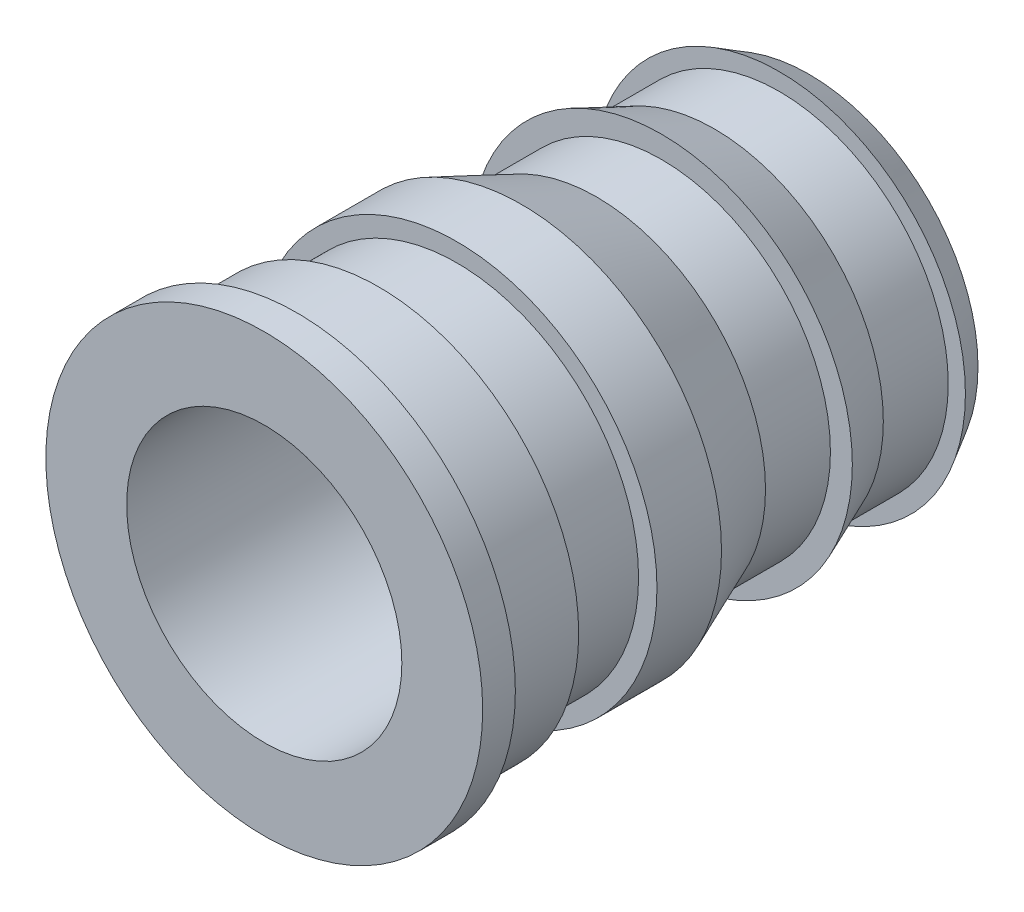
ISO-10303-21;
HEADER;
FILE_DESCRIPTION(('STEP AP214'),'2;1');
FILE_NAME('part.step','',(''),(''),'','','');
FILE_SCHEMA(('AUTOMOTIVE_DESIGN { 1 0 10303 214 1 1 1 1 }'));
ENDSEC;
DATA;
#1=APPLICATION_CONTEXT('core data for automotive mechanical design processes');
#2=APPLICATION_PROTOCOL_DEFINITION('international standard','automotive_design',2000,#1);
#3=PRODUCT_CONTEXT('',#1,'mechanical');
#4=PRODUCT('Part','Part','',(#3));
#5=PRODUCT_RELATED_PRODUCT_CATEGORY('part','',(#4));
#6=PRODUCT_DEFINITION_FORMATION('','',#4);
#7=PRODUCT_DEFINITION_CONTEXT('part definition',#1,'design');
#8=PRODUCT_DEFINITION('design','',#6,#7);
#9=PRODUCT_DEFINITION_SHAPE('','',#8);
#10=(LENGTH_UNIT() NAMED_UNIT(*) SI_UNIT(.MILLI.,.METRE.));
#11=(NAMED_UNIT(*) PLANE_ANGLE_UNIT() SI_UNIT($,.RADIAN.));
#12=(NAMED_UNIT(*) SI_UNIT($,.STERADIAN.) SOLID_ANGLE_UNIT());
#13=UNCERTAINTY_MEASURE_WITH_UNIT(LENGTH_MEASURE(1.E-05),#10,'distance_accuracy_value','');
#14=(GEOMETRIC_REPRESENTATION_CONTEXT(3) GLOBAL_UNCERTAINTY_ASSIGNED_CONTEXT((#13)) GLOBAL_UNIT_ASSIGNED_CONTEXT((#10,
#11,#12)) REPRESENTATION_CONTEXT('',''));
#15=CARTESIAN_POINT('',(0.,0.,0.));
#16=DIRECTION('',(0.,0.,1.));
#17=DIRECTION('',(1.,0.,0.));
#18=AXIS2_PLACEMENT_3D('',#15,#16,#17);
#19=CARTESIAN_POINT('',(0.,0.,3.96));
#20=DIRECTION('',(0.,0.,1.));
#21=DIRECTION('',(1.,0.,0.));
#22=AXIS2_PLACEMENT_3D('',#19,#20,#21);
#23=CYLINDRICAL_SURFACE('',#22,2.);
#24=CARTESIAN_POINT('',(0.,0.,-3.96));
#25=DIRECTION('',(0.,0.,1.));
#26=DIRECTION('',(1.,0.,0.));
#27=AXIS2_PLACEMENT_3D('',#24,#25,#26);
#28=CIRCLE('',#27,2.);
#29=CARTESIAN_POINT('',(2.,0.,-3.96));
#30=VERTEX_POINT('',#29);
#31=EDGE_CURVE('E110',#30,#30,#28,.T.);
#32=ORIENTED_EDGE('',*,*,#31,.F.);
#33=EDGE_LOOP('',(#32));
#34=FACE_BOUND('',#33,.T.);
#35=CARTESIAN_POINT('',(0.,0.,3.96));
#36=DIRECTION('',(0.,0.,1.));
#37=DIRECTION('',(1.,0.,0.));
#38=AXIS2_PLACEMENT_3D('',#35,#36,#37);
#39=CIRCLE('',#38,2.);
#40=CARTESIAN_POINT('',(2.,0.,3.96));
#41=VERTEX_POINT('',#40);
#42=EDGE_CURVE('E10',#41,#41,#39,.T.);
#43=ORIENTED_EDGE('',*,*,#42,.T.);
#44=EDGE_LOOP('',(#43));
#45=FACE_BOUND('',#44,.T.);
#46=ADVANCED_FACE('F39',(#34,#45),#23,.F.);
#47=CARTESIAN_POINT('',(0.,2.,3.96));
#48=DIRECTION('',(0.,0.,-1.));
#49=DIRECTION('',(-1.,0.,0.));
#50=AXIS2_PLACEMENT_3D('',#47,#48,#49);
#51=PLANE('',#50);
#52=ORIENTED_EDGE('',*,*,#42,.F.);
#53=EDGE_LOOP('',(#52));
#54=FACE_BOUND('',#53,.T.);
#55=CARTESIAN_POINT('',(0.,0.,3.96));
#56=DIRECTION('',(0.,0.,1.));
#57=DIRECTION('',(1.,0.,0.));
#58=AXIS2_PLACEMENT_3D('',#55,#56,#57);
#59=CIRCLE('',#58,3.175);
#60=CARTESIAN_POINT('',(3.175,0.,3.96));
#61=VERTEX_POINT('',#60);
#62=EDGE_CURVE('E46',#61,#61,#59,.T.);
#63=ORIENTED_EDGE('',*,*,#62,.T.);
#64=EDGE_LOOP('',(#63));
#65=FACE_BOUND('',#64,.T.);
#66=ADVANCED_FACE('F118',(#54,#65),#51,.F.);
#67=CARTESIAN_POINT('',(0.,0.,3.96));
#68=DIRECTION('',(0.,0.,1.));
#69=DIRECTION('',(1.,0.,0.));
#70=AXIS2_PLACEMENT_3D('',#67,#68,#69);
#71=CYLINDRICAL_SURFACE('',#70,3.175);
#72=ORIENTED_EDGE('',*,*,#62,.F.);
#73=EDGE_LOOP('',(#72));
#74=FACE_BOUND('',#73,.T.);
#75=CARTESIAN_POINT('',(0.,0.,3.4848));
#76=DIRECTION('',(0.,0.,1.));
#77=DIRECTION('',(1.,0.,0.));
#78=AXIS2_PLACEMENT_3D('',#75,#76,#77);
#79=CIRCLE('',#78,3.175);
#80=CARTESIAN_POINT('',(3.175,0.,3.4848));
#81=VERTEX_POINT('',#80);
#82=EDGE_CURVE('E51',#81,#81,#79,.T.);
#83=ORIENTED_EDGE('',*,*,#82,.T.);
#84=EDGE_LOOP('',(#83));
#85=FACE_BOUND('',#84,.T.);
#86=ADVANCED_FACE('F122',(#74,#85),#71,.T.);
#87=CARTESIAN_POINT('',(0.,3.175,3.4848));
#88=DIRECTION('',(0.,0.,1.));
#89=DIRECTION('',(1.,0.,0.));
#90=AXIS2_PLACEMENT_3D('',#87,#88,#89);
#91=PLANE('',#90);
#92=ORIENTED_EDGE('',*,*,#82,.F.);
#93=EDGE_LOOP('',(#92));
#94=FACE_BOUND('',#93,.T.);
#95=CARTESIAN_POINT('',(0.,0.,3.4848));
#96=DIRECTION('',(0.,0.,1.));
#97=DIRECTION('',(1.,0.,0.));
#98=AXIS2_PLACEMENT_3D('',#95,#96,#97);
#99=CIRCLE('',#98,2.9075);
#100=CARTESIAN_POINT('',(2.9075,0.,3.4848));
#101=VERTEX_POINT('',#100);
#102=EDGE_CURVE('E56',#101,#101,#99,.T.);
#103=ORIENTED_EDGE('',*,*,#102,.T.);
#104=EDGE_LOOP('',(#103));
#105=FACE_BOUND('',#104,.T.);
#106=ADVANCED_FACE('F127',(#94,#105),#91,.F.);
#107=CARTESIAN_POINT('',(0.,0.,3.96));
#108=DIRECTION('',(0.,0.,1.));
#109=DIRECTION('',(1.,0.,0.));
#110=AXIS2_PLACEMENT_3D('',#107,#108,#109);
#111=CYLINDRICAL_SURFACE('',#110,2.9075);
#112=ORIENTED_EDGE('',*,*,#102,.F.);
#113=EDGE_LOOP('',(#112));
#114=FACE_BOUND('',#113,.T.);
#115=CARTESIAN_POINT('',(0.,0.,2.2968));
#116=DIRECTION('',(0.,0.,1.));
#117=DIRECTION('',(1.,0.,0.));
#118=AXIS2_PLACEMENT_3D('',#115,#116,#117);
#119=CIRCLE('',#118,2.9075);
#120=CARTESIAN_POINT('',(2.9075,0.,2.2968));
#121=VERTEX_POINT('',#120);
#122=EDGE_CURVE('E62',#121,#121,#119,.T.);
#123=ORIENTED_EDGE('',*,*,#122,.T.);
#124=EDGE_LOOP('',(#123));
#125=FACE_BOUND('',#124,.T.);
#126=ADVANCED_FACE('F133',(#114,#125),#111,.T.);
#127=CARTESIAN_POINT('',(0.,2.9075,2.2968));
#128=DIRECTION('',(0.,0.,1.));
#129=DIRECTION('',(1.,0.,0.));
#130=AXIS2_PLACEMENT_3D('',#127,#128,#129);
#131=PLANE('',#130);
#132=ORIENTED_EDGE('',*,*,#122,.F.);
#133=EDGE_LOOP('',(#132));
#134=FACE_BOUND('',#133,.T.);
#135=CARTESIAN_POINT('',(0.,0.,2.2968));
#136=DIRECTION('',(0.,0.,1.));
#137=DIRECTION('',(1.,0.,0.));
#138=AXIS2_PLACEMENT_3D('',#135,#136,#137);
#139=CIRCLE('',#138,2.64);
#140=CARTESIAN_POINT('',(2.64,0.,2.2968));
#141=VERTEX_POINT('',#140);
#142=EDGE_CURVE('E66',#141,#141,#139,.T.);
#143=ORIENTED_EDGE('',*,*,#142,.T.);
#144=EDGE_LOOP('',(#143));
#145=FACE_BOUND('',#144,.T.);
#146=ADVANCED_FACE('F137',(#134,#145),#131,.F.);
#147=CARTESIAN_POINT('',(0.,0.,3.96));
#148=DIRECTION('',(0.,0.,1.));
#149=DIRECTION('',(1.,0.,0.));
#150=AXIS2_PLACEMENT_3D('',#147,#148,#149);
#151=CYLINDRICAL_SURFACE('',#150,2.64);
#152=ORIENTED_EDGE('',*,*,#142,.F.);
#153=EDGE_LOOP('',(#152));
#154=FACE_BOUND('',#153,.T.);
#155=CARTESIAN_POINT('',(0.,0.,1.15894666632655));
#156=DIRECTION('',(0.,0.,1.));
#157=DIRECTION('',(1.,0.,0.));
#158=AXIS2_PLACEMENT_3D('',#155,#156,#157);
#159=CIRCLE('',#158,2.64);
#160=CARTESIAN_POINT('',(2.64,0.,1.15894666632655));
#161=VERTEX_POINT('',#160);
#162=EDGE_CURVE('E70',#161,#161,#159,.T.);
#163=ORIENTED_EDGE('',*,*,#162,.T.);
#164=EDGE_LOOP('',(#163));
#165=FACE_BOUND('',#164,.T.);
#166=ADVANCED_FACE('F141',(#154,#165),#151,.T.);
#167=CARTESIAN_POINT('',(0.,2.64,1.15894666632655));
#168=DIRECTION('',(0.,0.,-1.));
#169=DIRECTION('',(-1.,0.,0.));
#170=AXIS2_PLACEMENT_3D('',#167,#168,#169);
#171=PLANE('',#170);
#172=ORIENTED_EDGE('',*,*,#162,.F.);
#173=EDGE_LOOP('',(#172));
#174=FACE_BOUND('',#173,.T.);
#175=CARTESIAN_POINT('',(0.,0.,1.15894666632655));
#176=DIRECTION('',(0.,0.,1.));
#177=DIRECTION('',(1.,0.,0.));
#178=AXIS2_PLACEMENT_3D('',#175,#176,#177);
#179=CIRCLE('',#178,2.9075);
#180=CARTESIAN_POINT('',(2.9075,0.,1.15894666632655));
#181=VERTEX_POINT('',#180);
#182=EDGE_CURVE('E74',#181,#181,#179,.T.);
#183=ORIENTED_EDGE('',*,*,#182,.T.);
#184=EDGE_LOOP('',(#183));
#185=FACE_BOUND('',#184,.T.);
#186=ADVANCED_FACE('F145',(#174,#185),#171,.F.);
#187=CARTESIAN_POINT('',(0.,0.,3.96));
#188=DIRECTION('',(0.,0.,1.));
#189=DIRECTION('',(1.,0.,0.));
#190=AXIS2_PLACEMENT_3D('',#187,#188,#189);
#191=CYLINDRICAL_SURFACE('',#190,2.9075);
#192=ORIENTED_EDGE('',*,*,#182,.F.);
#193=EDGE_LOOP('',(#192));
#194=FACE_BOUND('',#193,.T.);
#195=CARTESIAN_POINT('',(0.,0.,0.220748794261348));
#196=DIRECTION('',(0.,0.,1.));
#197=DIRECTION('',(1.,0.,0.));
#198=AXIS2_PLACEMENT_3D('',#195,#196,#197);
#199=CIRCLE('',#198,2.9075);
#200=CARTESIAN_POINT('',(2.9075,0.,0.220748794261348));
#201=VERTEX_POINT('',#200);
#202=EDGE_CURVE('E78',#201,#201,#199,.T.);
#203=ORIENTED_EDGE('',*,*,#202,.T.);
#204=EDGE_LOOP('',(#203));
#205=FACE_BOUND('',#204,.T.);
#206=ADVANCED_FACE('F149',(#194,#205),#191,.T.);
#207=CARTESIAN_POINT('',(0.,0.,-0.8712));
#208=DIRECTION('',(0.,0.,1.));
#209=DIRECTION('',(1.,0.,0.));
#210=AXIS2_PLACEMENT_3D('',#207,#208,#209);
#211=CONICAL_SURFACE('',#210,2.4552,0.392699081698725);
#212=ORIENTED_EDGE('',*,*,#202,.F.);
#213=EDGE_LOOP('',(#212));
#214=FACE_BOUND('',#213,.T.);
#215=CARTESIAN_POINT('',(0.,0.,-0.8712));
#216=DIRECTION('',(0.,0.,1.));
#217=DIRECTION('',(1.,0.,0.));
#218=AXIS2_PLACEMENT_3D('',#215,#216,#217);
#219=CIRCLE('',#218,2.4552);
#220=CARTESIAN_POINT('',(2.4552,0.,-0.8712));
#221=VERTEX_POINT('',#220);
#222=EDGE_CURVE('E82',#221,#221,#219,.T.);
#223=ORIENTED_EDGE('',*,*,#222,.T.);
#224=EDGE_LOOP('',(#223));
#225=FACE_BOUND('',#224,.T.);
#226=ADVANCED_FACE('F153',(#214,#225),#211,.T.);
#227=CARTESIAN_POINT('',(0.,0.,3.96));
#228=DIRECTION('',(0.,0.,1.));
#229=DIRECTION('',(1.,0.,0.));
#230=AXIS2_PLACEMENT_3D('',#227,#228,#229);
#231=CYLINDRICAL_SURFACE('',#230,2.4552);
#232=ORIENTED_EDGE('',*,*,#222,.F.);
#233=EDGE_LOOP('',(#232));
#234=FACE_BOUND('',#233,.T.);
#235=CARTESIAN_POINT('',(0.,0.,-1.81474298898767));
#236=DIRECTION('',(0.,0.,1.));
#237=DIRECTION('',(1.,0.,0.));
#238=AXIS2_PLACEMENT_3D('',#235,#236,#237);
#239=CIRCLE('',#238,2.4552);
#240=CARTESIAN_POINT('',(2.4552,0.,-1.81474298898767));
#241=VERTEX_POINT('',#240);
#242=EDGE_CURVE('E86',#241,#241,#239,.T.);
#243=ORIENTED_EDGE('',*,*,#242,.T.);
#244=EDGE_LOOP('',(#243));
#245=FACE_BOUND('',#244,.T.);
#246=ADVANCED_FACE('F157',(#234,#245),#231,.T.);
#247=CARTESIAN_POINT('',(0.,2.77375,-1.81474298898767));
#248=DIRECTION('',(0.,0.,-1.));
#249=DIRECTION('',(-1.,0.,0.));
#250=AXIS2_PLACEMENT_3D('',#247,#248,#249);
#251=PLANE('',#250);
#252=ORIENTED_EDGE('',*,*,#242,.F.);
#253=EDGE_LOOP('',(#252));
#254=FACE_BOUND('',#253,.T.);
#255=CARTESIAN_POINT('',(0.,0.,-1.81474298898767));
#256=DIRECTION('',(0.,0.,1.));
#257=DIRECTION('',(1.,0.,0.));
#258=AXIS2_PLACEMENT_3D('',#255,#256,#257);
#259=CIRCLE('',#258,2.77375);
#260=CARTESIAN_POINT('',(2.77375,0.,-1.81474298898767));
#261=VERTEX_POINT('',#260);
#262=EDGE_CURVE('E90',#261,#261,#259,.T.);
#263=ORIENTED_EDGE('',*,*,#262,.T.);
#264=EDGE_LOOP('',(#263));
#265=FACE_BOUND('',#264,.T.);
#266=ADVANCED_FACE('F161',(#254,#265),#251,.F.);
#267=CARTESIAN_POINT('',(0.,0.,-2.58379071928162));
#268=DIRECTION('',(0.,0.,1.));
#269=DIRECTION('',(1.,0.,0.));
#270=AXIS2_PLACEMENT_3D('',#267,#268,#269);
#271=CONICAL_SURFACE('',#270,2.4552,0.392699081698724);
#272=ORIENTED_EDGE('',*,*,#262,.F.);
#273=EDGE_LOOP('',(#272));
#274=FACE_BOUND('',#273,.T.);
#275=CARTESIAN_POINT('',(0.,0.,-2.58379071928162));
#276=DIRECTION('',(0.,0.,1.));
#277=DIRECTION('',(1.,0.,0.));
#278=AXIS2_PLACEMENT_3D('',#275,#276,#277);
#279=CIRCLE('',#278,2.4552);
#280=CARTESIAN_POINT('',(2.4552,0.,-2.58379071928162));
#281=VERTEX_POINT('',#280);
#282=EDGE_CURVE('E94',#281,#281,#279,.T.);
#283=ORIENTED_EDGE('',*,*,#282,.T.);
#284=EDGE_LOOP('',(#283));
#285=FACE_BOUND('',#284,.T.);
#286=ADVANCED_FACE('F165',(#274,#285),#271,.T.);
#287=CARTESIAN_POINT('',(0.,0.,3.96));
#288=DIRECTION('',(0.,0.,1.));
#289=DIRECTION('',(1.,0.,0.));
#290=AXIS2_PLACEMENT_3D('',#287,#288,#289);
#291=CYLINDRICAL_SURFACE('',#290,2.4552);
#292=ORIENTED_EDGE('',*,*,#282,.F.);
#293=EDGE_LOOP('',(#292));
#294=FACE_BOUND('',#293,.T.);
#295=CARTESIAN_POINT('',(0.,0.,-3.5273337082693));
#296=DIRECTION('',(0.,0.,1.));
#297=DIRECTION('',(1.,0.,0.));
#298=AXIS2_PLACEMENT_3D('',#295,#296,#297);
#299=CIRCLE('',#298,2.4552);
#300=CARTESIAN_POINT('',(2.4552,0.,-3.5273337082693));
#301=VERTEX_POINT('',#300);
#302=EDGE_CURVE('E98',#301,#301,#299,.T.);
#303=ORIENTED_EDGE('',*,*,#302,.T.);
#304=EDGE_LOOP('',(#303));
#305=FACE_BOUND('',#304,.T.);
#306=ADVANCED_FACE('F169',(#294,#305),#291,.T.);
#307=CARTESIAN_POINT('',(0.,2.4552,-3.5273337082693));
#308=DIRECTION('',(0.,0.,-1.));
#309=DIRECTION('',(-1.,0.,0.));
#310=AXIS2_PLACEMENT_3D('',#307,#308,#309);
#311=PLANE('',#310);
#312=ORIENTED_EDGE('',*,*,#302,.F.);
#313=EDGE_LOOP('',(#312));
#314=FACE_BOUND('',#313,.T.);
#315=CARTESIAN_POINT('',(0.,0.,-3.5273337082693));
#316=DIRECTION('',(0.,0.,1.));
#317=DIRECTION('',(1.,0.,0.));
#318=AXIS2_PLACEMENT_3D('',#315,#316,#317);
#319=CIRCLE('',#318,2.705);
#320=CARTESIAN_POINT('',(2.705,0.,-3.5273337082693));
#321=VERTEX_POINT('',#320);
#322=EDGE_CURVE('E102',#321,#321,#319,.T.);
#323=ORIENTED_EDGE('',*,*,#322,.T.);
#324=EDGE_LOOP('',(#323));
#325=FACE_BOUND('',#324,.T.);
#326=ADVANCED_FACE('F173',(#314,#325),#311,.F.);
#327=CARTESIAN_POINT('',(0.,0.,-3.96));
#328=DIRECTION('',(0.,0.,1.));
#329=DIRECTION('',(1.,0.,0.));
#330=AXIS2_PLACEMENT_3D('',#327,#328,#329);
#331=CONICAL_SURFACE('',#330,2.4552,0.5235987755983);
#332=ORIENTED_EDGE('',*,*,#322,.F.);
#333=EDGE_LOOP('',(#332));
#334=FACE_BOUND('',#333,.T.);
#335=CARTESIAN_POINT('',(0.,0.,-3.96));
#336=DIRECTION('',(0.,0.,1.));
#337=DIRECTION('',(1.,0.,0.));
#338=AXIS2_PLACEMENT_3D('',#335,#336,#337);
#339=CIRCLE('',#338,2.4552);
#340=CARTESIAN_POINT('',(2.4552,0.,-3.96));
#341=VERTEX_POINT('',#340);
#342=EDGE_CURVE('E106',#341,#341,#339,.T.);
#343=ORIENTED_EDGE('',*,*,#342,.T.);
#344=EDGE_LOOP('',(#343));
#345=FACE_BOUND('',#344,.T.);
#346=ADVANCED_FACE('F177',(#334,#345),#331,.T.);
#347=CARTESIAN_POINT('',(0.,2.4552,-3.96));
#348=DIRECTION('',(0.,0.,1.));
#349=DIRECTION('',(1.,0.,0.));
#350=AXIS2_PLACEMENT_3D('',#347,#348,#349);
#351=PLANE('',#350);
#352=ORIENTED_EDGE('',*,*,#342,.F.);
#353=EDGE_LOOP('',(#352));
#354=FACE_BOUND('',#353,.T.);
#355=ORIENTED_EDGE('',*,*,#31,.T.);
#356=EDGE_LOOP('',(#355));
#357=FACE_BOUND('',#356,.T.);
#358=ADVANCED_FACE('F115',(#354,#357),#351,.F.);
#359=CLOSED_SHELL('',(#46,#66,#86,#106,#126,#146,#166,#186,#206,#226,#246,#266,#286,#306,#326,
#346,#358));
#360=MANIFOLD_SOLID_BREP('B2',#359);
#361=ADVANCED_BREP_SHAPE_REPRESENTATION('',(#18,#360),#14);
#362=SHAPE_DEFINITION_REPRESENTATION(#9,#361);
ENDSEC;
END-ISO-10303-21;
